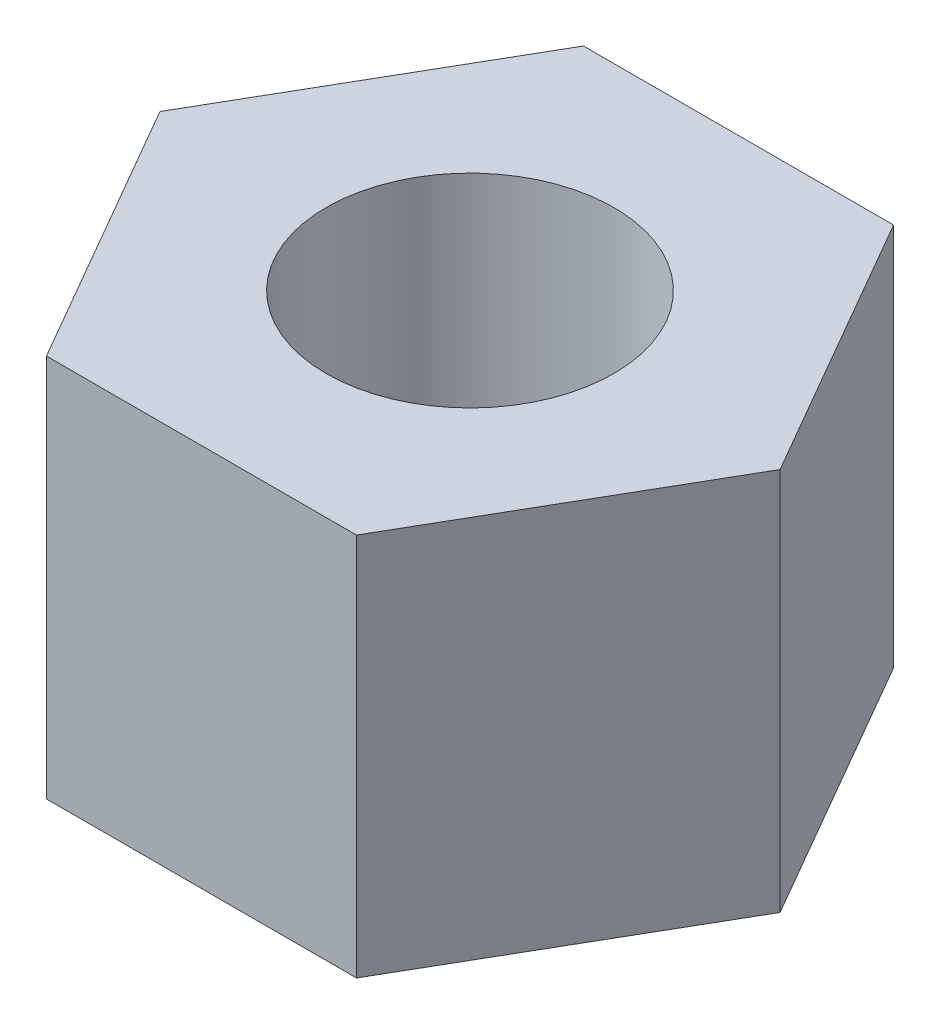
ISO-10303-21;
HEADER;
FILE_DESCRIPTION(('STEP AP214'),'2;1');
FILE_NAME('part.step','',(''),(''),'','','');
FILE_SCHEMA(('AUTOMOTIVE_DESIGN { 1 0 10303 214 1 1 1 1 }'));
ENDSEC;
DATA;
#1=APPLICATION_CONTEXT('core data for automotive mechanical design processes');
#2=APPLICATION_PROTOCOL_DEFINITION('international standard','automotive_design',2000,#1);
#3=PRODUCT_CONTEXT('',#1,'mechanical');
#4=PRODUCT('Part','Part','',(#3));
#5=PRODUCT_RELATED_PRODUCT_CATEGORY('part','',(#4));
#6=PRODUCT_DEFINITION_FORMATION('','',#4);
#7=PRODUCT_DEFINITION_CONTEXT('part definition',#1,'design');
#8=PRODUCT_DEFINITION('design','',#6,#7);
#9=PRODUCT_DEFINITION_SHAPE('','',#8);
#10=(LENGTH_UNIT() NAMED_UNIT(*) SI_UNIT(.MILLI.,.METRE.));
#11=(NAMED_UNIT(*) PLANE_ANGLE_UNIT() SI_UNIT($,.RADIAN.));
#12=(NAMED_UNIT(*) SI_UNIT($,.STERADIAN.) SOLID_ANGLE_UNIT());
#13=UNCERTAINTY_MEASURE_WITH_UNIT(LENGTH_MEASURE(1.E-05),#10,'distance_accuracy_value','');
#14=(GEOMETRIC_REPRESENTATION_CONTEXT(3) GLOBAL_UNCERTAINTY_ASSIGNED_CONTEXT((#13)) GLOBAL_UNIT_ASSIGNED_CONTEXT((#10,
#11,#12)) REPRESENTATION_CONTEXT('',''));
#15=CARTESIAN_POINT('',(0.,0.,0.));
#16=DIRECTION('',(0.,0.,1.));
#17=DIRECTION('',(1.,0.,0.));
#18=AXIS2_PLACEMENT_3D('',#15,#16,#17);
#19=CARTESIAN_POINT('',(0.,4.,0.));
#20=DIRECTION('',(0.,1.,0.));
#21=DIRECTION('',(0.,0.,1.));
#22=AXIS2_PLACEMENT_3D('',#19,#20,#21);
#23=PLANE('',#22);
#24=DIRECTION('',(0.5,0.,-0.866025403784439));
#25=VECTOR('',#24,1.);
#26=CARTESIAN_POINT('',(1.61658075373095,4.,2.8));
#27=LINE('',#26,#25);
#28=CARTESIAN_POINT('',(1.61658075373095,4.,2.8));
#29=VERTEX_POINT('',#28);
#30=CARTESIAN_POINT('',(3.2331615074619,4.,0.));
#31=VERTEX_POINT('',#30);
#32=EDGE_CURVE('E146',#29,#31,#27,.T.);
#33=ORIENTED_EDGE('',*,*,#32,.T.);
#34=DIRECTION('',(-0.5,0.,-0.866025403784438));
#35=VECTOR('',#34,1.);
#36=CARTESIAN_POINT('',(3.2331615074619,4.,0.));
#37=LINE('',#36,#35);
#38=CARTESIAN_POINT('',(1.61658075373095,4.,-2.8));
#39=VERTEX_POINT('',#38);
#40=EDGE_CURVE('E94',#31,#39,#37,.T.);
#41=ORIENTED_EDGE('',*,*,#40,.T.);
#42=DIRECTION('',(-1.,0.,0.));
#43=VECTOR('',#42,1.);
#44=CARTESIAN_POINT('',(1.61658075373095,4.,-2.8));
#45=LINE('',#44,#43);
#46=CARTESIAN_POINT('',(-1.61658075373095,4.,-2.8));
#47=VERTEX_POINT('',#46);
#48=EDGE_CURVE('E107',#39,#47,#45,.T.);
#49=ORIENTED_EDGE('',*,*,#48,.T.);
#50=DIRECTION('',(-0.5,0.,0.866025403784438));
#51=VECTOR('',#50,1.);
#52=CARTESIAN_POINT('',(-1.61658075373095,4.,-2.8));
#53=LINE('',#52,#51);
#54=CARTESIAN_POINT('',(-3.2331615074619,4.,0.));
#55=VERTEX_POINT('',#54);
#56=EDGE_CURVE('E101',#47,#55,#53,.T.);
#57=ORIENTED_EDGE('',*,*,#56,.T.);
#58=DIRECTION('',(0.5,0.,0.866025403784438));
#59=VECTOR('',#58,1.);
#60=CARTESIAN_POINT('',(-3.2331615074619,4.,0.));
#61=LINE('',#60,#59);
#62=CARTESIAN_POINT('',(-1.61658075373095,4.,2.8));
#63=VERTEX_POINT('',#62);
#64=EDGE_CURVE('E105',#55,#63,#61,.T.);
#65=ORIENTED_EDGE('',*,*,#64,.T.);
#66=DIRECTION('',(1.,0.,0.));
#67=VECTOR('',#66,1.);
#68=CARTESIAN_POINT('',(-1.61658075373095,4.,2.8));
#69=LINE('',#68,#67);
#70=EDGE_CURVE('E57',#63,#29,#69,.T.);
#71=ORIENTED_EDGE('',*,*,#70,.T.);
#72=EDGE_LOOP('',(#33,#41,#49,#57,#65,#71));
#73=FACE_BOUND('',#72,.T.);
#74=CARTESIAN_POINT('',(0.,4.,0.));
#75=DIRECTION('',(0.,1.,0.));
#76=DIRECTION('',(0.,0.,1.));
#77=AXIS2_PLACEMENT_3D('',#74,#75,#76);
#78=CIRCLE('',#77,1.5);
#79=CARTESIAN_POINT('',(0.,4.,1.5));
#80=VERTEX_POINT('',#79);
#81=EDGE_CURVE('E134',#80,#80,#78,.T.);
#82=ORIENTED_EDGE('',*,*,#81,.F.);
#83=EDGE_LOOP('',(#82));
#84=FACE_BOUND('',#83,.T.);
#85=ADVANCED_FACE('F39',(#73,#84),#23,.T.);
#86=CARTESIAN_POINT('',(0.,0.,0.));
#87=DIRECTION('',(0.,1.,0.));
#88=DIRECTION('',(0.,0.,1.));
#89=AXIS2_PLACEMENT_3D('',#86,#87,#88);
#90=PLANE('',#89);
#91=DIRECTION('',(0.5,0.,-0.866025403784439));
#92=VECTOR('',#91,1.);
#93=CARTESIAN_POINT('',(1.61658075373095,0.,2.8));
#94=LINE('',#93,#92);
#95=CARTESIAN_POINT('',(1.61658075373095,0.,2.8));
#96=VERTEX_POINT('',#95);
#97=CARTESIAN_POINT('',(3.2331615074619,0.,0.));
#98=VERTEX_POINT('',#97);
#99=EDGE_CURVE('E129',#96,#98,#94,.T.);
#100=ORIENTED_EDGE('',*,*,#99,.F.);
#101=DIRECTION('',(1.,0.,0.));
#102=VECTOR('',#101,1.);
#103=CARTESIAN_POINT('',(-1.61658075373095,0.,2.8));
#104=LINE('',#103,#102);
#105=CARTESIAN_POINT('',(-1.61658075373095,0.,2.8));
#106=VERTEX_POINT('',#105);
#107=EDGE_CURVE('E86',#106,#96,#104,.T.);
#108=ORIENTED_EDGE('',*,*,#107,.F.);
#109=DIRECTION('',(0.5,0.,0.866025403784438));
#110=VECTOR('',#109,1.);
#111=CARTESIAN_POINT('',(-3.2331615074619,0.,0.));
#112=LINE('',#111,#110);
#113=CARTESIAN_POINT('',(-3.2331615074619,0.,0.));
#114=VERTEX_POINT('',#113);
#115=EDGE_CURVE('E80',#114,#106,#112,.T.);
#116=ORIENTED_EDGE('',*,*,#115,.F.);
#117=DIRECTION('',(-0.5,0.,0.866025403784438));
#118=VECTOR('',#117,1.);
#119=CARTESIAN_POINT('',(-1.61658075373095,0.,-2.8));
#120=LINE('',#119,#118);
#121=CARTESIAN_POINT('',(-1.61658075373095,0.,-2.8));
#122=VERTEX_POINT('',#121);
#123=EDGE_CURVE('E116',#122,#114,#120,.T.);
#124=ORIENTED_EDGE('',*,*,#123,.F.);
#125=DIRECTION('',(-1.,0.,0.));
#126=VECTOR('',#125,1.);
#127=CARTESIAN_POINT('',(1.61658075373095,0.,-2.8));
#128=LINE('',#127,#126);
#129=CARTESIAN_POINT('',(1.61658075373095,0.,-2.8));
#130=VERTEX_POINT('',#129);
#131=EDGE_CURVE('E137',#130,#122,#128,.T.);
#132=ORIENTED_EDGE('',*,*,#131,.F.);
#133=DIRECTION('',(-0.5,0.,-0.866025403784438));
#134=VECTOR('',#133,1.);
#135=CARTESIAN_POINT('',(3.2331615074619,0.,0.));
#136=LINE('',#135,#134);
#137=EDGE_CURVE('E133',#98,#130,#136,.T.);
#138=ORIENTED_EDGE('',*,*,#137,.F.);
#139=EDGE_LOOP('',(#100,#108,#116,#124,#132,#138));
#140=FACE_BOUND('',#139,.T.);
#141=CARTESIAN_POINT('',(0.,0.,0.));
#142=DIRECTION('',(0.,1.,0.));
#143=DIRECTION('',(0.,0.,1.));
#144=AXIS2_PLACEMENT_3D('',#141,#142,#143);
#145=CIRCLE('',#144,1.5);
#146=CARTESIAN_POINT('',(0.,0.,1.5));
#147=VERTEX_POINT('',#146);
#148=EDGE_CURVE('E243',#147,#147,#145,.T.);
#149=ORIENTED_EDGE('',*,*,#148,.T.);
#150=EDGE_LOOP('',(#149));
#151=FACE_BOUND('',#150,.T.);
#152=ADVANCED_FACE('F159',(#140,#151),#90,.F.);
#153=CARTESIAN_POINT('',(1.61658075373095,4.,2.8));
#154=DIRECTION('',(-0.866025403784439,0.,-0.5));
#155=DIRECTION('',(-0.5,0.,0.866025403784439));
#156=AXIS2_PLACEMENT_3D('',#153,#154,#155);
#157=PLANE('',#156);
#158=ORIENTED_EDGE('',*,*,#99,.T.);
#159=DIRECTION('',(0.,-1.,0.));
#160=VECTOR('',#159,1.);
#161=CARTESIAN_POINT('',(3.2331615074619,4.,0.));
#162=LINE('',#161,#160);
#163=EDGE_CURVE('E11',#31,#98,#162,.T.);
#164=ORIENTED_EDGE('',*,*,#163,.F.);
#165=ORIENTED_EDGE('',*,*,#32,.F.);
#166=DIRECTION('',(0.,-1.,0.));
#167=VECTOR('',#166,1.);
#168=CARTESIAN_POINT('',(1.61658075373095,4.,2.8));
#169=LINE('',#168,#167);
#170=EDGE_CURVE('E125',#29,#96,#169,.T.);
#171=ORIENTED_EDGE('',*,*,#170,.T.);
#172=EDGE_LOOP('',(#158,#164,#165,#171));
#173=FACE_BOUND('',#172,.T.);
#174=ADVANCED_FACE('F41',(#173),#157,.F.);
#175=CARTESIAN_POINT('',(3.2331615074619,4.,0.));
#176=DIRECTION('',(-0.866025403784438,0.,0.5));
#177=DIRECTION('',(0.5,0.,0.866025403784438));
#178=AXIS2_PLACEMENT_3D('',#175,#176,#177);
#179=PLANE('',#178);
#180=ORIENTED_EDGE('',*,*,#137,.T.);
#181=DIRECTION('',(0.,-1.,0.));
#182=VECTOR('',#181,1.);
#183=CARTESIAN_POINT('',(1.61658075373095,4.,-2.8));
#184=LINE('',#183,#182);
#185=EDGE_CURVE('E49',#39,#130,#184,.T.);
#186=ORIENTED_EDGE('',*,*,#185,.F.);
#187=ORIENTED_EDGE('',*,*,#40,.F.);
#188=ORIENTED_EDGE('',*,*,#163,.T.);
#189=EDGE_LOOP('',(#180,#186,#187,#188));
#190=FACE_BOUND('',#189,.T.);
#191=ADVANCED_FACE('F184',(#190),#179,.F.);
#192=CARTESIAN_POINT('',(1.61658075373095,4.,-2.8));
#193=DIRECTION('',(0.,0.,1.));
#194=DIRECTION('',(1.,0.,0.));
#195=AXIS2_PLACEMENT_3D('',#192,#193,#194);
#196=PLANE('',#195);
#197=ORIENTED_EDGE('',*,*,#131,.T.);
#198=DIRECTION('',(0.,-1.,0.));
#199=VECTOR('',#198,1.);
#200=CARTESIAN_POINT('',(-1.61658075373095,4.,-2.8));
#201=LINE('',#200,#199);
#202=EDGE_CURVE('E118',#47,#122,#201,.T.);
#203=ORIENTED_EDGE('',*,*,#202,.F.);
#204=ORIENTED_EDGE('',*,*,#48,.F.);
#205=ORIENTED_EDGE('',*,*,#185,.T.);
#206=EDGE_LOOP('',(#197,#203,#204,#205));
#207=FACE_BOUND('',#206,.T.);
#208=ADVANCED_FACE('F156',(#207),#196,.F.);
#209=CARTESIAN_POINT('',(-1.61658075373095,4.,-2.8));
#210=DIRECTION('',(0.866025403784439,0.,0.5));
#211=DIRECTION('',(0.5,0.,-0.866025403784439));
#212=AXIS2_PLACEMENT_3D('',#209,#210,#211);
#213=PLANE('',#212);
#214=ORIENTED_EDGE('',*,*,#123,.T.);
#215=DIRECTION('',(0.,-1.,0.));
#216=VECTOR('',#215,1.);
#217=CARTESIAN_POINT('',(-3.2331615074619,4.,0.));
#218=LINE('',#217,#216);
#219=EDGE_CURVE('E113',#55,#114,#218,.T.);
#220=ORIENTED_EDGE('',*,*,#219,.F.);
#221=ORIENTED_EDGE('',*,*,#56,.F.);
#222=ORIENTED_EDGE('',*,*,#202,.T.);
#223=EDGE_LOOP('',(#214,#220,#221,#222));
#224=FACE_BOUND('',#223,.T.);
#225=ADVANCED_FACE('F114',(#224),#213,.F.);
#226=CARTESIAN_POINT('',(-3.2331615074619,4.,0.));
#227=DIRECTION('',(0.866025403784438,0.,-0.5));
#228=DIRECTION('',(-0.5,0.,-0.866025403784438));
#229=AXIS2_PLACEMENT_3D('',#226,#227,#228);
#230=PLANE('',#229);
#231=ORIENTED_EDGE('',*,*,#115,.T.);
#232=DIRECTION('',(0.,-1.,0.));
#233=VECTOR('',#232,1.);
#234=CARTESIAN_POINT('',(-1.61658075373095,4.,2.8));
#235=LINE('',#234,#233);
#236=EDGE_CURVE('E119',#63,#106,#235,.T.);
#237=ORIENTED_EDGE('',*,*,#236,.F.);
#238=ORIENTED_EDGE('',*,*,#64,.F.);
#239=ORIENTED_EDGE('',*,*,#219,.T.);
#240=EDGE_LOOP('',(#231,#237,#238,#239));
#241=FACE_BOUND('',#240,.T.);
#242=ADVANCED_FACE('F121',(#241),#230,.F.);
#243=CARTESIAN_POINT('',(-1.61658075373095,4.,2.8));
#244=DIRECTION('',(0.,0.,-1.));
#245=DIRECTION('',(-1.,0.,0.));
#246=AXIS2_PLACEMENT_3D('',#243,#244,#245);
#247=PLANE('',#246);
#248=ORIENTED_EDGE('',*,*,#107,.T.);
#249=ORIENTED_EDGE('',*,*,#170,.F.);
#250=ORIENTED_EDGE('',*,*,#70,.F.);
#251=ORIENTED_EDGE('',*,*,#236,.T.);
#252=EDGE_LOOP('',(#248,#249,#250,#251));
#253=FACE_BOUND('',#252,.T.);
#254=ADVANCED_FACE('F164',(#253),#247,.F.);
#255=CARTESIAN_POINT('',(0.,4.,0.));
#256=DIRECTION('',(0.,-1.,0.));
#257=DIRECTION('',(0.,0.,-1.));
#258=AXIS2_PLACEMENT_3D('',#255,#256,#257);
#259=CYLINDRICAL_SURFACE('',#258,1.5);
#260=ORIENTED_EDGE('',*,*,#81,.T.);
#261=EDGE_LOOP('',(#260));
#262=FACE_BOUND('',#261,.T.);
#263=ORIENTED_EDGE('',*,*,#148,.F.);
#264=EDGE_LOOP('',(#263));
#265=FACE_BOUND('',#264,.T.);
#266=ADVANCED_FACE('F166',(#262,#265),#259,.F.);
#267=CLOSED_SHELL('',(#85,#152,#174,#191,#208,#225,#242,#254,#266));
#268=MANIFOLD_SOLID_BREP('B2',#267);
#269=ADVANCED_BREP_SHAPE_REPRESENTATION('',(#18,#268),#14);
#270=SHAPE_DEFINITION_REPRESENTATION(#9,#269);
ENDSEC;
END-ISO-10303-21;
